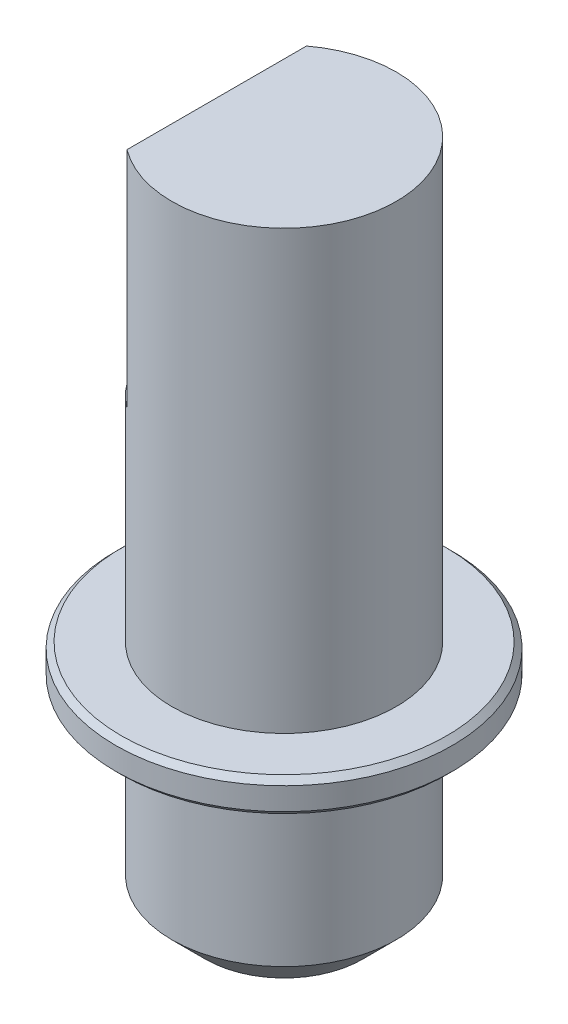
ISO-10303-21;
HEADER;
FILE_DESCRIPTION(('STEP AP214'),'2;1');
FILE_NAME('part.step','',(''),(''),'','','');
FILE_SCHEMA(('AUTOMOTIVE_DESIGN { 1 0 10303 214 1 1 1 1 }'));
ENDSEC;
DATA;
#1=APPLICATION_CONTEXT('core data for automotive mechanical design processes');
#2=APPLICATION_PROTOCOL_DEFINITION('international standard','automotive_design',2000,#1);
#3=PRODUCT_CONTEXT('',#1,'mechanical');
#4=PRODUCT('Part','Part','',(#3));
#5=PRODUCT_RELATED_PRODUCT_CATEGORY('part','',(#4));
#6=PRODUCT_DEFINITION_FORMATION('','',#4);
#7=PRODUCT_DEFINITION_CONTEXT('part definition',#1,'design');
#8=PRODUCT_DEFINITION('design','',#6,#7);
#9=PRODUCT_DEFINITION_SHAPE('','',#8);
#10=(LENGTH_UNIT() NAMED_UNIT(*) SI_UNIT(.MILLI.,.METRE.));
#11=(NAMED_UNIT(*) PLANE_ANGLE_UNIT() SI_UNIT($,.RADIAN.));
#12=(NAMED_UNIT(*) SI_UNIT($,.STERADIAN.) SOLID_ANGLE_UNIT());
#13=UNCERTAINTY_MEASURE_WITH_UNIT(LENGTH_MEASURE(1.E-05),#10,'distance_accuracy_value','');
#14=(GEOMETRIC_REPRESENTATION_CONTEXT(3) GLOBAL_UNCERTAINTY_ASSIGNED_CONTEXT((#13)) GLOBAL_UNIT_ASSIGNED_CONTEXT((#10,
#11,#12)) REPRESENTATION_CONTEXT('',''));
#15=CARTESIAN_POINT('',(0.,0.,0.));
#16=DIRECTION('',(0.,0.,1.));
#17=DIRECTION('',(1.,0.,0.));
#18=AXIS2_PLACEMENT_3D('',#15,#16,#17);
#19=CARTESIAN_POINT('',(0.,60.,0.));
#20=DIRECTION('',(0.,-1.,0.));
#21=DIRECTION('',(0.,0.,-1.));
#22=AXIS2_PLACEMENT_3D('',#19,#20,#21);
#23=CYLINDRICAL_SURFACE('',#22,10.);
#24=CARTESIAN_POINT('',(0.,3.,0.));
#25=DIRECTION('',(0.,1.,0.));
#26=DIRECTION('',(0.,0.,1.));
#27=AXIS2_PLACEMENT_3D('',#24,#25,#26);
#28=CIRCLE('',#27,10.);
#29=CARTESIAN_POINT('',(0.,3.,10.));
#30=VERTEX_POINT('',#29);
#31=EDGE_CURVE('E129',#30,#30,#28,.T.);
#32=ORIENTED_EDGE('',*,*,#31,.T.);
#33=EDGE_LOOP('',(#32));
#34=FACE_BOUND('',#33,.T.);
#35=CARTESIAN_POINT('',(0.,18.,0.));
#36=DIRECTION('',(0.,1.,0.));
#37=DIRECTION('',(0.,0.,1.));
#38=AXIS2_PLACEMENT_3D('',#35,#36,#37);
#39=CIRCLE('',#38,10.);
#40=CARTESIAN_POINT('',(0.,18.,10.));
#41=VERTEX_POINT('',#40);
#42=EDGE_CURVE('E137',#41,#41,#39,.T.);
#43=ORIENTED_EDGE('',*,*,#42,.F.);
#44=EDGE_LOOP('',(#43));
#45=FACE_BOUND('',#44,.T.);
#46=ADVANCED_FACE('F41',(#34,#45),#23,.T.);
#47=CARTESIAN_POINT('',(0.,0.,0.));
#48=DIRECTION('',(0.,1.,0.));
#49=DIRECTION('',(0.,0.,1.));
#50=AXIS2_PLACEMENT_3D('',#47,#48,#49);
#51=PLANE('',#50);
#52=CARTESIAN_POINT('',(0.,0.,0.));
#53=DIRECTION('',(0.,1.,0.));
#54=DIRECTION('',(0.,0.,1.));
#55=AXIS2_PLACEMENT_3D('',#52,#53,#54);
#56=CIRCLE('',#55,6.99999999999999);
#57=CARTESIAN_POINT('',(0.,0.,6.99999999999999));
#58=VERTEX_POINT('',#57);
#59=EDGE_CURVE('E133',#58,#58,#56,.F.);
#60=ORIENTED_EDGE('',*,*,#59,.T.);
#61=EDGE_LOOP('',(#60));
#62=FACE_BOUND('',#61,.T.);
#63=CARTESIAN_POINT('',(0.,0.,0.));
#64=DIRECTION('',(0.,-1.,0.));
#65=DIRECTION('',(0.,0.,-1.));
#66=AXIS2_PLACEMENT_3D('',#63,#64,#65);
#67=CIRCLE('',#66,4.);
#68=CARTESIAN_POINT('',(-2.5,0.,-3.1224989991992));
#69=VERTEX_POINT('',#68);
#70=CARTESIAN_POINT('',(-2.5,0.,3.1224989991992));
#71=VERTEX_POINT('',#70);
#72=EDGE_CURVE('E121',#69,#71,#67,.T.);
#73=ORIENTED_EDGE('',*,*,#72,.F.);
#74=DIRECTION('',(0.,0.,1.));
#75=VECTOR('',#74,1.);
#76=CARTESIAN_POINT('',(-2.5,0.,3.1224989991992));
#77=LINE('',#76,#75);
#78=EDGE_CURVE('E105',#69,#71,#77,.T.);
#79=ORIENTED_EDGE('',*,*,#78,.T.);
#80=EDGE_LOOP('',(#73,#79));
#81=FACE_BOUND('',#80,.T.);
#82=ADVANCED_FACE('F192',(#62,#81),#51,.F.);
#83=CARTESIAN_POINT('',(0.,15.,0.));
#84=DIRECTION('',(0.,-1.,0.));
#85=DIRECTION('',(0.,0.,-1.));
#86=AXIS2_PLACEMENT_3D('',#83,#84,#85);
#87=CYLINDRICAL_SURFACE('',#86,4.);
#88=ORIENTED_EDGE('',*,*,#72,.T.);
#89=DIRECTION('',(0.,-1.,0.));
#90=VECTOR('',#89,1.);
#91=CARTESIAN_POINT('',(-2.5,60.002,3.1224989991992));
#92=LINE('',#91,#90);
#93=CARTESIAN_POINT('',(-2.5,15.,3.1224989991992));
#94=VERTEX_POINT('',#93);
#95=EDGE_CURVE('E112',#94,#71,#92,.T.);
#96=ORIENTED_EDGE('',*,*,#95,.F.);
#97=CARTESIAN_POINT('',(0.,15.,0.));
#98=DIRECTION('',(0.,-1.,0.));
#99=DIRECTION('',(0.,0.,-1.));
#100=AXIS2_PLACEMENT_3D('',#97,#98,#99);
#101=CIRCLE('',#100,4.);
#102=CARTESIAN_POINT('',(-2.5,15.,-3.1224989991992));
#103=VERTEX_POINT('',#102);
#104=EDGE_CURVE('E122',#103,#94,#101,.T.);
#105=ORIENTED_EDGE('',*,*,#104,.F.);
#106=DIRECTION('',(0.,-1.,0.));
#107=VECTOR('',#106,1.);
#108=CARTESIAN_POINT('',(-2.5,60.002,-3.1224989991992));
#109=LINE('',#108,#107);
#110=EDGE_CURVE('E66',#103,#69,#109,.T.);
#111=ORIENTED_EDGE('',*,*,#110,.T.);
#112=EDGE_LOOP('',(#88,#96,#105,#111));
#113=FACE_BOUND('',#112,.T.);
#114=ADVANCED_FACE('F197',(#113),#87,.F.);
#115=CARTESIAN_POINT('',(0.,15.,0.));
#116=DIRECTION('',(0.,-1.,0.));
#117=DIRECTION('',(0.,0.,-1.));
#118=AXIS2_PLACEMENT_3D('',#115,#116,#117);
#119=PLANE('',#118);
#120=DIRECTION('',(0.,0.,-1.));
#121=VECTOR('',#120,1.);
#122=CARTESIAN_POINT('',(-2.5,15.,3.1224989991992));
#123=LINE('',#122,#121);
#124=EDGE_CURVE('E115',#94,#103,#123,.T.);
#125=ORIENTED_EDGE('',*,*,#124,.T.);
#126=ORIENTED_EDGE('',*,*,#104,.T.);
#127=EDGE_LOOP('',(#125,#126));
#128=FACE_BOUND('',#127,.T.);
#129=ADVANCED_FACE('F214',(#128),#119,.T.);
#130=CARTESIAN_POINT('',(-2.5,60.002,3.1224989991992));
#131=DIRECTION('',(1.,0.,0.));
#132=DIRECTION('',(0.,0.,-1.));
#133=AXIS2_PLACEMENT_3D('',#130,#131,#132);
#134=PLANE('',#133);
#135=ORIENTED_EDGE('',*,*,#124,.F.);
#136=ORIENTED_EDGE('',*,*,#95,.T.);
#137=ORIENTED_EDGE('',*,*,#78,.F.);
#138=ORIENTED_EDGE('',*,*,#110,.F.);
#139=EDGE_LOOP('',(#135,#136,#137,#138));
#140=FACE_BOUND('',#139,.T.);
#141=ADVANCED_FACE('F211',(#140),#134,.T.);
#142=CARTESIAN_POINT('',(0.,3.,0.));
#143=DIRECTION('',(0.,1.,0.));
#144=DIRECTION('',(0.,0.,1.));
#145=AXIS2_PLACEMENT_3D('',#142,#143,#144);
#146=CONICAL_SURFACE('',#145,10.,0.785398163397449);
#147=ORIENTED_EDGE('',*,*,#59,.F.);
#148=EDGE_LOOP('',(#147));
#149=FACE_BOUND('',#148,.T.);
#150=ORIENTED_EDGE('',*,*,#31,.F.);
#151=EDGE_LOOP('',(#150));
#152=FACE_BOUND('',#151,.T.);
#153=ADVANCED_FACE('F168',(#149,#152),#146,.T.);
#154=CARTESIAN_POINT('',(0.,21.,0.));
#155=DIRECTION('',(0.,-1.,0.));
#156=DIRECTION('',(0.,0.,-1.));
#157=AXIS2_PLACEMENT_3D('',#154,#155,#156);
#158=CYLINDRICAL_SURFACE('',#157,15.);
#159=CARTESIAN_POINT('',(0.,18.5,0.));
#160=DIRECTION('',(0.,1.,0.));
#161=DIRECTION('',(0.,0.,1.));
#162=AXIS2_PLACEMENT_3D('',#159,#160,#161);
#163=CIRCLE('',#162,15.);
#164=CARTESIAN_POINT('',(0.,18.5,15.));
#165=VERTEX_POINT('',#164);
#166=EDGE_CURVE('E149',#165,#165,#163,.T.);
#167=ORIENTED_EDGE('',*,*,#166,.T.);
#168=EDGE_LOOP('',(#167));
#169=FACE_BOUND('',#168,.T.);
#170=CARTESIAN_POINT('',(0.,20.5,0.));
#171=DIRECTION('',(0.,1.,0.));
#172=DIRECTION('',(0.,0.,1.));
#173=AXIS2_PLACEMENT_3D('',#170,#171,#172);
#174=CIRCLE('',#173,15.);
#175=CARTESIAN_POINT('',(0.,20.5,15.));
#176=VERTEX_POINT('',#175);
#177=EDGE_CURVE('E141',#176,#176,#174,.F.);
#178=ORIENTED_EDGE('',*,*,#177,.T.);
#179=EDGE_LOOP('',(#178));
#180=FACE_BOUND('',#179,.T.);
#181=ADVANCED_FACE('F164',(#169,#180),#158,.T.);
#182=CARTESIAN_POINT('',(0.,21.,0.));
#183=DIRECTION('',(0.,1.,0.));
#184=DIRECTION('',(0.,0.,1.));
#185=AXIS2_PLACEMENT_3D('',#182,#183,#184);
#186=PLANE('',#185);
#187=CARTESIAN_POINT('',(0.,21.,0.));
#188=DIRECTION('',(0.,1.,0.));
#189=DIRECTION('',(0.,0.,1.));
#190=AXIS2_PLACEMENT_3D('',#187,#188,#189);
#191=CIRCLE('',#190,14.5);
#192=CARTESIAN_POINT('',(0.,21.,14.5));
#193=VERTEX_POINT('',#192);
#194=EDGE_CURVE('E11',#193,#193,#191,.T.);
#195=ORIENTED_EDGE('',*,*,#194,.T.);
#196=EDGE_LOOP('',(#195));
#197=FACE_BOUND('',#196,.T.);
#198=CARTESIAN_POINT('',(0.,21.,0.));
#199=DIRECTION('',(0.,1.,0.));
#200=DIRECTION('',(0.,0.,1.));
#201=AXIS2_PLACEMENT_3D('',#198,#199,#200);
#202=CIRCLE('',#201,10.);
#203=CARTESIAN_POINT('',(0.,21.,10.));
#204=VERTEX_POINT('',#203);
#205=EDGE_CURVE('E142',#204,#204,#202,.T.);
#206=ORIENTED_EDGE('',*,*,#205,.F.);
#207=EDGE_LOOP('',(#206));
#208=FACE_BOUND('',#207,.T.);
#209=ADVANCED_FACE('F167',(#197,#208),#186,.T.);
#210=CARTESIAN_POINT('',(0.,18.,0.));
#211=DIRECTION('',(0.,1.,0.));
#212=DIRECTION('',(0.,0.,1.));
#213=AXIS2_PLACEMENT_3D('',#210,#211,#212);
#214=PLANE('',#213);
#215=CARTESIAN_POINT('',(0.,18.,0.));
#216=DIRECTION('',(0.,1.,0.));
#217=DIRECTION('',(0.,0.,1.));
#218=AXIS2_PLACEMENT_3D('',#215,#216,#217);
#219=CIRCLE('',#218,14.5);
#220=CARTESIAN_POINT('',(0.,18.,14.5));
#221=VERTEX_POINT('',#220);
#222=EDGE_CURVE('E51',#221,#221,#219,.F.);
#223=ORIENTED_EDGE('',*,*,#222,.T.);
#224=EDGE_LOOP('',(#223));
#225=FACE_BOUND('',#224,.T.);
#226=ORIENTED_EDGE('',*,*,#42,.T.);
#227=EDGE_LOOP('',(#226));
#228=FACE_BOUND('',#227,.T.);
#229=ADVANCED_FACE('F156',(#225,#228),#214,.F.);
#230=CARTESIAN_POINT('',(0.,40.,0.));
#231=DIRECTION('',(0.,1.,0.));
#232=DIRECTION('',(0.,0.,1.));
#233=AXIS2_PLACEMENT_3D('',#230,#231,#232);
#234=PLANE('',#233);
#235=CARTESIAN_POINT('',(0.,40.,0.));
#236=DIRECTION('',(0.,1.,0.));
#237=DIRECTION('',(0.,0.,1.));
#238=AXIS2_PLACEMENT_3D('',#235,#236,#237);
#239=CIRCLE('',#238,10.);
#240=CARTESIAN_POINT('',(-6.,40.,-8.));
#241=VERTEX_POINT('',#240);
#242=CARTESIAN_POINT('',(-6.,40.,8.));
#243=VERTEX_POINT('',#242);
#244=EDGE_CURVE('E86',#241,#243,#239,.T.);
#245=ORIENTED_EDGE('',*,*,#244,.T.);
#246=DIRECTION('',(0.,0.,-1.));
#247=VECTOR('',#246,1.);
#248=CARTESIAN_POINT('',(-6.,40.,-8.));
#249=LINE('',#248,#247);
#250=EDGE_CURVE('E88',#243,#241,#249,.T.);
#251=ORIENTED_EDGE('',*,*,#250,.T.);
#252=EDGE_LOOP('',(#245,#251));
#253=FACE_BOUND('',#252,.T.);
#254=ADVANCED_FACE('F87',(#253),#234,.T.);
#255=CARTESIAN_POINT('',(-6.,40.,-8.));
#256=DIRECTION('',(1.,0.,0.));
#257=DIRECTION('',(0.,0.,-1.));
#258=AXIS2_PLACEMENT_3D('',#255,#256,#257);
#259=PLANE('',#258);
#260=DIRECTION('',(0.,0.,-1.));
#261=VECTOR('',#260,1.);
#262=CARTESIAN_POINT('',(-6.,60.,-8.));
#263=LINE('',#262,#261);
#264=CARTESIAN_POINT('',(-6.,60.,8.));
#265=VERTEX_POINT('',#264);
#266=CARTESIAN_POINT('',(-6.,60.,-8.));
#267=VERTEX_POINT('',#266);
#268=EDGE_CURVE('E92',#265,#267,#263,.T.);
#269=ORIENTED_EDGE('',*,*,#268,.T.);
#270=DIRECTION('',(0.,1.,0.));
#271=VECTOR('',#270,1.);
#272=CARTESIAN_POINT('',(-6.,40.,-8.));
#273=LINE('',#272,#271);
#274=EDGE_CURVE('E95',#241,#267,#273,.T.);
#275=ORIENTED_EDGE('',*,*,#274,.F.);
#276=ORIENTED_EDGE('',*,*,#250,.F.);
#277=DIRECTION('',(0.,1.,0.));
#278=VECTOR('',#277,1.);
#279=CARTESIAN_POINT('',(-6.,40.,8.));
#280=LINE('',#279,#278);
#281=EDGE_CURVE('E58',#243,#265,#280,.T.);
#282=ORIENTED_EDGE('',*,*,#281,.T.);
#283=EDGE_LOOP('',(#269,#275,#276,#282));
#284=FACE_BOUND('',#283,.T.);
#285=ADVANCED_FACE('F94',(#284),#259,.F.);
#286=CARTESIAN_POINT('',(0.,60.,0.));
#287=DIRECTION('',(0.,1.,0.));
#288=DIRECTION('',(0.,0.,1.));
#289=AXIS2_PLACEMENT_3D('',#286,#287,#288);
#290=PLANE('',#289);
#291=ORIENTED_EDGE('',*,*,#268,.F.);
#292=CARTESIAN_POINT('',(0.,60.,0.));
#293=DIRECTION('',(0.,1.,0.));
#294=DIRECTION('',(0.,0.,1.));
#295=AXIS2_PLACEMENT_3D('',#292,#293,#294);
#296=CIRCLE('',#295,10.);
#297=EDGE_CURVE('E101',#265,#267,#296,.T.);
#298=ORIENTED_EDGE('',*,*,#297,.T.);
#299=EDGE_LOOP('',(#291,#298));
#300=FACE_BOUND('',#299,.T.);
#301=ADVANCED_FACE('F182',(#300),#290,.T.);
#302=ORIENTED_EDGE('',*,*,#205,.T.);
#303=EDGE_LOOP('',(#302));
#304=FACE_BOUND('',#303,.T.);
#305=ORIENTED_EDGE('',*,*,#297,.F.);
#306=ORIENTED_EDGE('',*,*,#281,.F.);
#307=ORIENTED_EDGE('',*,*,#244,.F.);
#308=ORIENTED_EDGE('',*,*,#274,.T.);
#309=EDGE_LOOP('',(#305,#306,#307,#308));
#310=FACE_BOUND('',#309,.T.);
#311=ADVANCED_FACE('F99',(#304,#310),#23,.T.);
#312=CARTESIAN_POINT('',(0.,18.5,0.));
#313=DIRECTION('',(0.,1.,0.));
#314=DIRECTION('',(0.,0.,1.));
#315=AXIS2_PLACEMENT_3D('',#312,#313,#314);
#316=CONICAL_SURFACE('',#315,15.,0.785398163397459);
#317=ORIENTED_EDGE('',*,*,#222,.F.);
#318=EDGE_LOOP('',(#317));
#319=FACE_BOUND('',#318,.T.);
#320=ORIENTED_EDGE('',*,*,#166,.F.);
#321=EDGE_LOOP('',(#320));
#322=FACE_BOUND('',#321,.T.);
#323=ADVANCED_FACE('F159',(#319,#322),#316,.T.);
#324=CARTESIAN_POINT('',(0.,21.,0.));
#325=DIRECTION('',(0.,-1.,0.));
#326=DIRECTION('',(0.,0.,-1.));
#327=AXIS2_PLACEMENT_3D('',#324,#325,#326);
#328=CONICAL_SURFACE('',#327,14.5,0.78539816339744);
#329=ORIENTED_EDGE('',*,*,#177,.F.);
#330=EDGE_LOOP('',(#329));
#331=FACE_BOUND('',#330,.T.);
#332=ORIENTED_EDGE('',*,*,#194,.F.);
#333=EDGE_LOOP('',(#332));
#334=FACE_BOUND('',#333,.T.);
#335=ADVANCED_FACE('F44',(#331,#334),#328,.T.);
#336=CLOSED_SHELL('',(#46,#82,#114,#129,#141,#153,#181,#209,#229,#254,#285,#301,#311,#323,#335));
#337=MANIFOLD_SOLID_BREP('B2',#336);
#338=ADVANCED_BREP_SHAPE_REPRESENTATION('',(#18,#337),#14);
#339=SHAPE_DEFINITION_REPRESENTATION(#9,#338);
ENDSEC;
END-ISO-10303-21;
